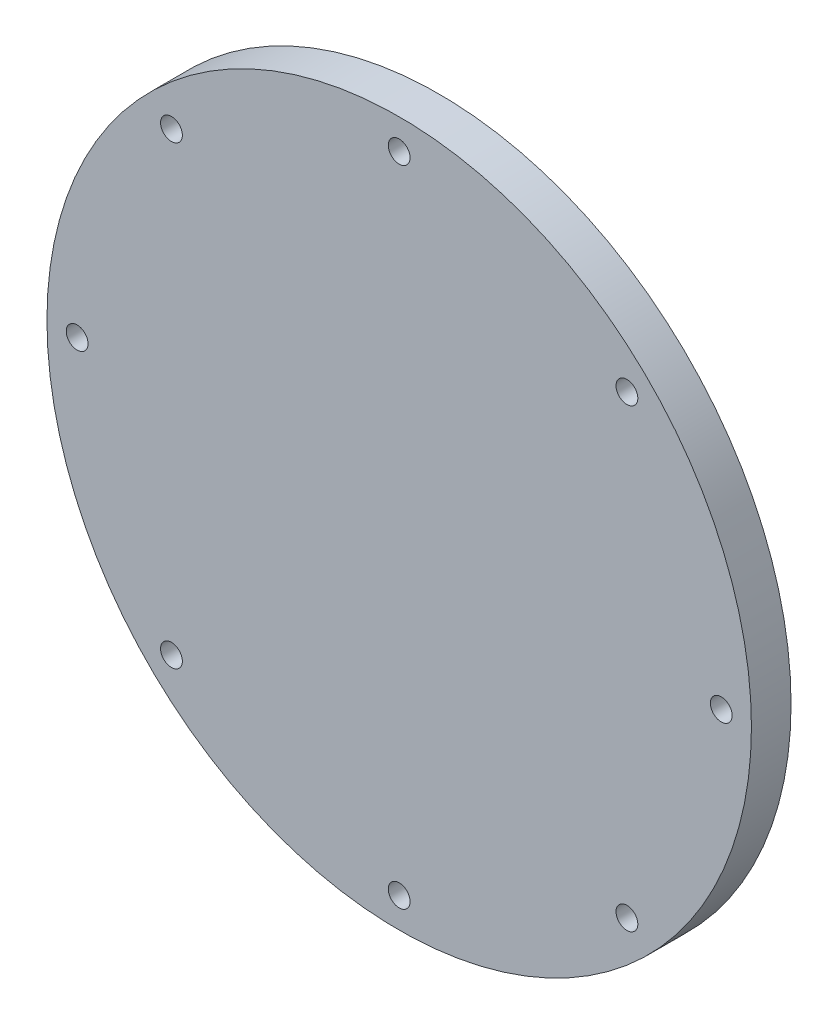
ISO-10303-21;
HEADER;
FILE_DESCRIPTION(('STEP AP214'),'2;1');
FILE_NAME('part.step','',(''),(''),'','','');
FILE_SCHEMA(('AUTOMOTIVE_DESIGN { 1 0 10303 214 1 1 1 1 }'));
ENDSEC;
DATA;
#1=APPLICATION_CONTEXT('core data for automotive mechanical design processes');
#2=APPLICATION_PROTOCOL_DEFINITION('international standard','automotive_design',2000,#1);
#3=PRODUCT_CONTEXT('',#1,'mechanical');
#4=PRODUCT('Part','Part','',(#3));
#5=PRODUCT_RELATED_PRODUCT_CATEGORY('part','',(#4));
#6=PRODUCT_DEFINITION_FORMATION('','',#4);
#7=PRODUCT_DEFINITION_CONTEXT('part definition',#1,'design');
#8=PRODUCT_DEFINITION('design','',#6,#7);
#9=PRODUCT_DEFINITION_SHAPE('','',#8);
#10=(LENGTH_UNIT() NAMED_UNIT(*) SI_UNIT(.MILLI.,.METRE.));
#11=(NAMED_UNIT(*) PLANE_ANGLE_UNIT() SI_UNIT($,.RADIAN.));
#12=(NAMED_UNIT(*) SI_UNIT($,.STERADIAN.) SOLID_ANGLE_UNIT());
#13=UNCERTAINTY_MEASURE_WITH_UNIT(LENGTH_MEASURE(1.E-05),#10,'distance_accuracy_value','');
#14=(GEOMETRIC_REPRESENTATION_CONTEXT(3) GLOBAL_UNCERTAINTY_ASSIGNED_CONTEXT((#13)) GLOBAL_UNIT_ASSIGNED_CONTEXT((#10,
#11,#12)) REPRESENTATION_CONTEXT('',''));
#15=CARTESIAN_POINT('',(0.,0.,0.));
#16=DIRECTION('',(0.,0.,1.));
#17=DIRECTION('',(1.,0.,0.));
#18=AXIS2_PLACEMENT_3D('',#15,#16,#17);
#19=CARTESIAN_POINT('',(0.,0.,10.));
#20=DIRECTION('',(0.,0.,-1.));
#21=DIRECTION('',(-1.,0.,0.));
#22=AXIS2_PLACEMENT_3D('',#19,#20,#21);
#23=CYLINDRICAL_SURFACE('',#22,88.9);
#24=CARTESIAN_POINT('',(0.,0.,10.));
#25=DIRECTION('',(0.,0.,1.));
#26=DIRECTION('',(1.,0.,0.));
#27=AXIS2_PLACEMENT_3D('',#24,#25,#26);
#28=CIRCLE('',#27,88.9);
#29=CARTESIAN_POINT('',(88.9,0.,10.));
#30=VERTEX_POINT('',#29);
#31=EDGE_CURVE('E10',#30,#30,#28,.T.);
#32=ORIENTED_EDGE('',*,*,#31,.F.);
#33=EDGE_LOOP('',(#32));
#34=FACE_BOUND('',#33,.T.);
#35=CARTESIAN_POINT('',(0.,0.,0.));
#36=DIRECTION('',(0.,0.,1.));
#37=DIRECTION('',(1.,0.,0.));
#38=AXIS2_PLACEMENT_3D('',#35,#36,#37);
#39=CIRCLE('',#38,88.9);
#40=CARTESIAN_POINT('',(88.9,0.,0.));
#41=VERTEX_POINT('',#40);
#42=EDGE_CURVE('E35',#41,#41,#39,.T.);
#43=ORIENTED_EDGE('',*,*,#42,.T.);
#44=EDGE_LOOP('',(#43));
#45=FACE_BOUND('',#44,.T.);
#46=ADVANCED_FACE('F32',(#34,#45),#23,.T.);
#47=CARTESIAN_POINT('',(0.,0.,10.));
#48=DIRECTION('',(0.,0.,1.));
#49=DIRECTION('',(1.,0.,0.));
#50=AXIS2_PLACEMENT_3D('',#47,#48,#49);
#51=PLANE('',#50);
#52=CARTESIAN_POINT('',(0.,81.28,10.));
#53=DIRECTION('',(0.,0.,1.));
#54=DIRECTION('',(1.,0.,0.));
#55=AXIS2_PLACEMENT_3D('',#52,#53,#54);
#56=CIRCLE('',#55,2.75);
#57=CARTESIAN_POINT('',(2.75,81.28,10.));
#58=VERTEX_POINT('',#57);
#59=EDGE_CURVE('E86',#58,#58,#56,.T.);
#60=ORIENTED_EDGE('',*,*,#59,.F.);
#61=EDGE_LOOP('',(#60));
#62=FACE_BOUND('',#61,.T.);
#63=CARTESIAN_POINT('',(57.4736391748435,57.4736391748449,10.));
#64=DIRECTION('',(0.,0.,1.));
#65=DIRECTION('',(1.,0.,0.));
#66=AXIS2_PLACEMENT_3D('',#63,#64,#65);
#67=CIRCLE('',#66,2.75);
#68=CARTESIAN_POINT('',(60.2236391748435,57.4736391748449,10.));
#69=VERTEX_POINT('',#68);
#70=EDGE_CURVE('E80',#69,#69,#67,.T.);
#71=ORIENTED_EDGE('',*,*,#70,.F.);
#72=EDGE_LOOP('',(#71));
#73=FACE_BOUND('',#72,.T.);
#74=CARTESIAN_POINT('',(81.2800000000032,3.23958063957266E-12,10.));
#75=DIRECTION('',(0.,0.,1.));
#76=DIRECTION('',(1.,0.,0.));
#77=AXIS2_PLACEMENT_3D('',#74,#75,#76);
#78=CIRCLE('',#77,2.75000000000001);
#79=CARTESIAN_POINT('',(84.0300000000032,3.23958063957266E-12,10.));
#80=VERTEX_POINT('',#79);
#81=EDGE_CURVE('E74',#80,#80,#78,.T.);
#82=ORIENTED_EDGE('',*,*,#81,.F.);
#83=EDGE_LOOP('',(#82));
#84=FACE_BOUND('',#83,.T.);
#85=CARTESIAN_POINT('',(57.4736391748481,-57.4736391748403,10.));
#86=DIRECTION('',(0.,0.,1.));
#87=DIRECTION('',(1.,0.,0.));
#88=AXIS2_PLACEMENT_3D('',#85,#86,#87);
#89=CIRCLE('',#88,2.75);
#90=CARTESIAN_POINT('',(60.2236391748481,-57.4736391748403,10.));
#91=VERTEX_POINT('',#90);
#92=EDGE_CURVE('E68',#91,#91,#89,.T.);
#93=ORIENTED_EDGE('',*,*,#92,.F.);
#94=EDGE_LOOP('',(#93));
#95=FACE_BOUND('',#94,.T.);
#96=CARTESIAN_POINT('',(6.47916127914532E-12,-81.28,10.));
#97=DIRECTION('',(0.,0.,1.));
#98=DIRECTION('',(1.,0.,0.));
#99=AXIS2_PLACEMENT_3D('',#96,#97,#98);
#100=CIRCLE('',#99,2.75);
#101=CARTESIAN_POINT('',(2.75000000000648,-81.28,10.));
#102=VERTEX_POINT('',#101);
#103=EDGE_CURVE('E62',#102,#102,#100,.T.);
#104=ORIENTED_EDGE('',*,*,#103,.F.);
#105=EDGE_LOOP('',(#104));
#106=FACE_BOUND('',#105,.T.);
#107=CARTESIAN_POINT('',(-57.4736391748371,-57.4736391748449,10.));
#108=DIRECTION('',(0.,0.,1.));
#109=DIRECTION('',(1.,0.,0.));
#110=AXIS2_PLACEMENT_3D('',#107,#108,#109);
#111=CIRCLE('',#110,2.75);
#112=CARTESIAN_POINT('',(-54.7236391748371,-57.4736391748449,10.));
#113=VERTEX_POINT('',#112);
#114=EDGE_CURVE('E56',#113,#113,#111,.T.);
#115=ORIENTED_EDGE('',*,*,#114,.F.);
#116=EDGE_LOOP('',(#115));
#117=FACE_BOUND('',#116,.T.);
#118=CARTESIAN_POINT('',(-81.2799999999968,-3.24953456875613E-12,10.));
#119=DIRECTION('',(0.,0.,1.));
#120=DIRECTION('',(1.,0.,0.));
#121=AXIS2_PLACEMENT_3D('',#118,#119,#120);
#122=CIRCLE('',#121,2.75000000000001);
#123=CARTESIAN_POINT('',(-78.5299999999968,-3.24953456875613E-12,10.));
#124=VERTEX_POINT('',#123);
#125=EDGE_CURVE('E50',#124,#124,#122,.T.);
#126=ORIENTED_EDGE('',*,*,#125,.F.);
#127=EDGE_LOOP('',(#126));
#128=FACE_BOUND('',#127,.T.);
#129=CARTESIAN_POINT('',(-57.4736391748417,57.4736391748403,10.));
#130=DIRECTION('',(0.,0.,1.));
#131=DIRECTION('',(1.,0.,0.));
#132=AXIS2_PLACEMENT_3D('',#129,#130,#131);
#133=CIRCLE('',#132,2.75);
#134=CARTESIAN_POINT('',(-54.7236391748416,57.4736391748403,10.));
#135=VERTEX_POINT('',#134);
#136=EDGE_CURVE('E44',#135,#135,#133,.T.);
#137=ORIENTED_EDGE('',*,*,#136,.F.);
#138=EDGE_LOOP('',(#137));
#139=FACE_BOUND('',#138,.T.);
#140=ORIENTED_EDGE('',*,*,#31,.T.);
#141=EDGE_LOOP('',(#140));
#142=FACE_BOUND('',#141,.T.);
#143=ADVANCED_FACE('F102',(#62,#73,#84,#95,#106,#117,#128,#139,#142),#51,.T.);
#144=CARTESIAN_POINT('',(0.,0.,0.));
#145=DIRECTION('',(0.,0.,1.));
#146=DIRECTION('',(1.,0.,0.));
#147=AXIS2_PLACEMENT_3D('',#144,#145,#146);
#148=PLANE('',#147);
#149=CARTESIAN_POINT('',(0.,81.28,0.));
#150=DIRECTION('',(0.,0.,1.));
#151=DIRECTION('',(1.,0.,0.));
#152=AXIS2_PLACEMENT_3D('',#149,#150,#151);
#153=CIRCLE('',#152,2.75);
#154=CARTESIAN_POINT('',(2.75,81.28,0.));
#155=VERTEX_POINT('',#154);
#156=EDGE_CURVE('E42',#155,#155,#153,.T.);
#157=ORIENTED_EDGE('',*,*,#156,.T.);
#158=EDGE_LOOP('',(#157));
#159=FACE_BOUND('',#158,.T.);
#160=CARTESIAN_POINT('',(57.4736391748435,57.4736391748449,0.));
#161=DIRECTION('',(0.,0.,1.));
#162=DIRECTION('',(1.,0.,0.));
#163=AXIS2_PLACEMENT_3D('',#160,#161,#162);
#164=CIRCLE('',#163,2.75);
#165=CARTESIAN_POINT('',(60.2236391748435,57.4736391748449,0.));
#166=VERTEX_POINT('',#165);
#167=EDGE_CURVE('E83',#166,#166,#164,.T.);
#168=ORIENTED_EDGE('',*,*,#167,.T.);
#169=EDGE_LOOP('',(#168));
#170=FACE_BOUND('',#169,.T.);
#171=CARTESIAN_POINT('',(81.2800000000032,3.23958063957266E-12,0.));
#172=DIRECTION('',(0.,0.,1.));
#173=DIRECTION('',(1.,0.,0.));
#174=AXIS2_PLACEMENT_3D('',#171,#172,#173);
#175=CIRCLE('',#174,2.75000000000001);
#176=CARTESIAN_POINT('',(84.0300000000032,3.23958063957266E-12,0.));
#177=VERTEX_POINT('',#176);
#178=EDGE_CURVE('E77',#177,#177,#175,.T.);
#179=ORIENTED_EDGE('',*,*,#178,.T.);
#180=EDGE_LOOP('',(#179));
#181=FACE_BOUND('',#180,.T.);
#182=CARTESIAN_POINT('',(57.4736391748481,-57.4736391748403,0.));
#183=DIRECTION('',(0.,0.,1.));
#184=DIRECTION('',(1.,0.,0.));
#185=AXIS2_PLACEMENT_3D('',#182,#183,#184);
#186=CIRCLE('',#185,2.75);
#187=CARTESIAN_POINT('',(60.2236391748481,-57.4736391748403,0.));
#188=VERTEX_POINT('',#187);
#189=EDGE_CURVE('E71',#188,#188,#186,.T.);
#190=ORIENTED_EDGE('',*,*,#189,.T.);
#191=EDGE_LOOP('',(#190));
#192=FACE_BOUND('',#191,.T.);
#193=CARTESIAN_POINT('',(6.47916127914532E-12,-81.28,0.));
#194=DIRECTION('',(0.,0.,1.));
#195=DIRECTION('',(1.,0.,0.));
#196=AXIS2_PLACEMENT_3D('',#193,#194,#195);
#197=CIRCLE('',#196,2.75);
#198=CARTESIAN_POINT('',(2.75000000000648,-81.28,0.));
#199=VERTEX_POINT('',#198);
#200=EDGE_CURVE('E65',#199,#199,#197,.T.);
#201=ORIENTED_EDGE('',*,*,#200,.T.);
#202=EDGE_LOOP('',(#201));
#203=FACE_BOUND('',#202,.T.);
#204=CARTESIAN_POINT('',(-57.4736391748371,-57.4736391748449,0.));
#205=DIRECTION('',(0.,0.,1.));
#206=DIRECTION('',(1.,0.,0.));
#207=AXIS2_PLACEMENT_3D('',#204,#205,#206);
#208=CIRCLE('',#207,2.75);
#209=CARTESIAN_POINT('',(-54.7236391748371,-57.4736391748449,0.));
#210=VERTEX_POINT('',#209);
#211=EDGE_CURVE('E59',#210,#210,#208,.T.);
#212=ORIENTED_EDGE('',*,*,#211,.T.);
#213=EDGE_LOOP('',(#212));
#214=FACE_BOUND('',#213,.T.);
#215=CARTESIAN_POINT('',(-81.2799999999968,-3.24953456875613E-12,0.));
#216=DIRECTION('',(0.,0.,1.));
#217=DIRECTION('',(1.,0.,0.));
#218=AXIS2_PLACEMENT_3D('',#215,#216,#217);
#219=CIRCLE('',#218,2.75000000000001);
#220=CARTESIAN_POINT('',(-78.5299999999968,-3.24953456875613E-12,0.));
#221=VERTEX_POINT('',#220);
#222=EDGE_CURVE('E53',#221,#221,#219,.T.);
#223=ORIENTED_EDGE('',*,*,#222,.T.);
#224=EDGE_LOOP('',(#223));
#225=FACE_BOUND('',#224,.T.);
#226=CARTESIAN_POINT('',(-57.4736391748417,57.4736391748403,0.));
#227=DIRECTION('',(0.,0.,1.));
#228=DIRECTION('',(1.,0.,0.));
#229=AXIS2_PLACEMENT_3D('',#226,#227,#228);
#230=CIRCLE('',#229,2.75);
#231=CARTESIAN_POINT('',(-54.7236391748416,57.4736391748403,0.));
#232=VERTEX_POINT('',#231);
#233=EDGE_CURVE('E47',#232,#232,#230,.T.);
#234=ORIENTED_EDGE('',*,*,#233,.T.);
#235=EDGE_LOOP('',(#234));
#236=FACE_BOUND('',#235,.T.);
#237=ORIENTED_EDGE('',*,*,#42,.F.);
#238=EDGE_LOOP('',(#237));
#239=FACE_BOUND('',#238,.T.);
#240=ADVANCED_FACE('F92',(#159,#170,#181,#192,#203,#214,#225,#236,#239),#148,.F.);
#241=CARTESIAN_POINT('',(-57.4736391748417,57.4736391748403,0.));
#242=DIRECTION('',(0.,0.,1.));
#243=DIRECTION('',(1.,0.,0.));
#244=AXIS2_PLACEMENT_3D('',#241,#242,#243);
#245=CYLINDRICAL_SURFACE('',#244,2.75);
#246=ORIENTED_EDGE('',*,*,#233,.F.);
#247=EDGE_LOOP('',(#246));
#248=FACE_BOUND('',#247,.T.);
#249=ORIENTED_EDGE('',*,*,#136,.T.);
#250=EDGE_LOOP('',(#249));
#251=FACE_BOUND('',#250,.T.);
#252=ADVANCED_FACE('F120',(#248,#251),#245,.F.);
#253=CARTESIAN_POINT('',(-81.2799999999968,-3.24953456875613E-12,0.));
#254=DIRECTION('',(0.,0.,1.));
#255=DIRECTION('',(1.,0.,0.));
#256=AXIS2_PLACEMENT_3D('',#253,#254,#255);
#257=CYLINDRICAL_SURFACE('',#256,2.75000000000001);
#258=ORIENTED_EDGE('',*,*,#222,.F.);
#259=EDGE_LOOP('',(#258));
#260=FACE_BOUND('',#259,.T.);
#261=ORIENTED_EDGE('',*,*,#125,.T.);
#262=EDGE_LOOP('',(#261));
#263=FACE_BOUND('',#262,.T.);
#264=ADVANCED_FACE('F122',(#260,#263),#257,.F.);
#265=CARTESIAN_POINT('',(-57.4736391748371,-57.4736391748449,0.));
#266=DIRECTION('',(0.,0.,1.));
#267=DIRECTION('',(1.,0.,0.));
#268=AXIS2_PLACEMENT_3D('',#265,#266,#267);
#269=CYLINDRICAL_SURFACE('',#268,2.75);
#270=ORIENTED_EDGE('',*,*,#211,.F.);
#271=EDGE_LOOP('',(#270));
#272=FACE_BOUND('',#271,.T.);
#273=ORIENTED_EDGE('',*,*,#114,.T.);
#274=EDGE_LOOP('',(#273));
#275=FACE_BOUND('',#274,.T.);
#276=ADVANCED_FACE('F129',(#272,#275),#269,.F.);
#277=CARTESIAN_POINT('',(6.47916127914532E-12,-81.28,0.));
#278=DIRECTION('',(0.,0.,1.));
#279=DIRECTION('',(1.,0.,0.));
#280=AXIS2_PLACEMENT_3D('',#277,#278,#279);
#281=CYLINDRICAL_SURFACE('',#280,2.75);
#282=ORIENTED_EDGE('',*,*,#200,.F.);
#283=EDGE_LOOP('',(#282));
#284=FACE_BOUND('',#283,.T.);
#285=ORIENTED_EDGE('',*,*,#103,.T.);
#286=EDGE_LOOP('',(#285));
#287=FACE_BOUND('',#286,.T.);
#288=ADVANCED_FACE('F167',(#284,#287),#281,.F.);
#289=CARTESIAN_POINT('',(57.4736391748481,-57.4736391748403,0.));
#290=DIRECTION('',(0.,0.,1.));
#291=DIRECTION('',(1.,0.,0.));
#292=AXIS2_PLACEMENT_3D('',#289,#290,#291);
#293=CYLINDRICAL_SURFACE('',#292,2.75);
#294=ORIENTED_EDGE('',*,*,#189,.F.);
#295=EDGE_LOOP('',(#294));
#296=FACE_BOUND('',#295,.T.);
#297=ORIENTED_EDGE('',*,*,#92,.T.);
#298=EDGE_LOOP('',(#297));
#299=FACE_BOUND('',#298,.T.);
#300=ADVANCED_FACE('F177',(#296,#299),#293,.F.);
#301=CARTESIAN_POINT('',(81.2800000000032,3.23958063957266E-12,0.));
#302=DIRECTION('',(0.,0.,1.));
#303=DIRECTION('',(1.,0.,0.));
#304=AXIS2_PLACEMENT_3D('',#301,#302,#303);
#305=CYLINDRICAL_SURFACE('',#304,2.75000000000001);
#306=ORIENTED_EDGE('',*,*,#178,.F.);
#307=EDGE_LOOP('',(#306));
#308=FACE_BOUND('',#307,.T.);
#309=ORIENTED_EDGE('',*,*,#81,.T.);
#310=EDGE_LOOP('',(#309));
#311=FACE_BOUND('',#310,.T.);
#312=ADVANCED_FACE('F187',(#308,#311),#305,.F.);
#313=CARTESIAN_POINT('',(57.4736391748435,57.4736391748449,0.));
#314=DIRECTION('',(0.,0.,1.));
#315=DIRECTION('',(1.,0.,0.));
#316=AXIS2_PLACEMENT_3D('',#313,#314,#315);
#317=CYLINDRICAL_SURFACE('',#316,2.75);
#318=ORIENTED_EDGE('',*,*,#167,.F.);
#319=EDGE_LOOP('',(#318));
#320=FACE_BOUND('',#319,.T.);
#321=ORIENTED_EDGE('',*,*,#70,.T.);
#322=EDGE_LOOP('',(#321));
#323=FACE_BOUND('',#322,.T.);
#324=ADVANCED_FACE('F98',(#320,#323),#317,.F.);
#325=CARTESIAN_POINT('',(0.,81.28,0.));
#326=DIRECTION('',(0.,0.,1.));
#327=DIRECTION('',(1.,0.,0.));
#328=AXIS2_PLACEMENT_3D('',#325,#326,#327);
#329=CYLINDRICAL_SURFACE('',#328,2.75);
#330=ORIENTED_EDGE('',*,*,#156,.F.);
#331=EDGE_LOOP('',(#330));
#332=FACE_BOUND('',#331,.T.);
#333=ORIENTED_EDGE('',*,*,#59,.T.);
#334=EDGE_LOOP('',(#333));
#335=FACE_BOUND('',#334,.T.);
#336=ADVANCED_FACE('F95',(#332,#335),#329,.F.);
#337=CLOSED_SHELL('',(#46,#143,#240,#252,#264,#276,#288,#300,#312,#324,#336));
#338=MANIFOLD_SOLID_BREP('B2',#337);
#339=ADVANCED_BREP_SHAPE_REPRESENTATION('',(#18,#338),#14);
#340=SHAPE_DEFINITION_REPRESENTATION(#9,#339);
ENDSEC;
END-ISO-10303-21;
